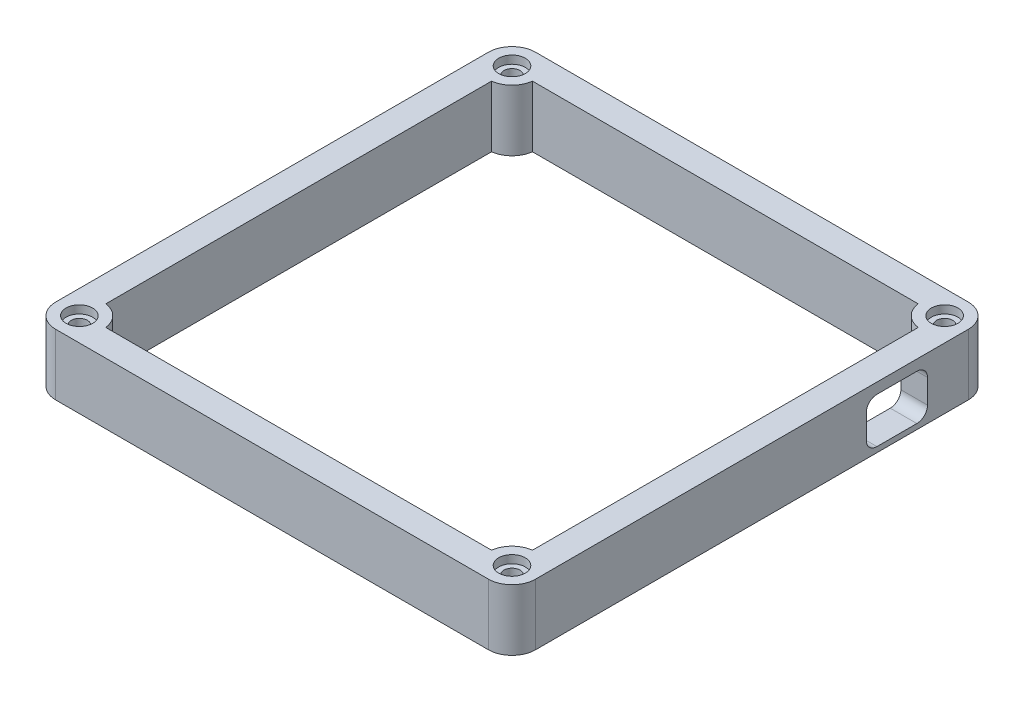
ISO-10303-21;
HEADER;
FILE_DESCRIPTION(('STEP AP214'),'2;1');
FILE_NAME('part.step','',(''),(''),'','','');
FILE_SCHEMA(('AUTOMOTIVE_DESIGN { 1 0 10303 214 1 1 1 1 }'));
ENDSEC;
DATA;
#1=APPLICATION_CONTEXT('core data for automotive mechanical design processes');
#2=APPLICATION_PROTOCOL_DEFINITION('international standard','automotive_design',2000,#1);
#3=PRODUCT_CONTEXT('',#1,'mechanical');
#4=PRODUCT('Part','Part','',(#3));
#5=PRODUCT_RELATED_PRODUCT_CATEGORY('part','',(#4));
#6=PRODUCT_DEFINITION_FORMATION('','',#4);
#7=PRODUCT_DEFINITION_CONTEXT('part definition',#1,'design');
#8=PRODUCT_DEFINITION('design','',#6,#7);
#9=PRODUCT_DEFINITION_SHAPE('','',#8);
#10=(LENGTH_UNIT() NAMED_UNIT(*) SI_UNIT(.MILLI.,.METRE.));
#11=(NAMED_UNIT(*) PLANE_ANGLE_UNIT() SI_UNIT($,.RADIAN.));
#12=(NAMED_UNIT(*) SI_UNIT($,.STERADIAN.) SOLID_ANGLE_UNIT());
#13=UNCERTAINTY_MEASURE_WITH_UNIT(LENGTH_MEASURE(1.E-05),#10,'distance_accuracy_value','');
#14=(GEOMETRIC_REPRESENTATION_CONTEXT(3) GLOBAL_UNCERTAINTY_ASSIGNED_CONTEXT((#13)) GLOBAL_UNIT_ASSIGNED_CONTEXT((#10,
#11,#12)) REPRESENTATION_CONTEXT('',''));
#15=CARTESIAN_POINT('',(0.,0.,0.));
#16=DIRECTION('',(0.,0.,1.));
#17=DIRECTION('',(1.,0.,0.));
#18=AXIS2_PLACEMENT_3D('',#15,#16,#17);
#19=CARTESIAN_POINT('',(45.0808846481362,11.5,0.));
#20=DIRECTION('',(1.,0.,0.));
#21=DIRECTION('',(0.,0.,-1.));
#22=AXIS2_PLACEMENT_3D('',#19,#20,#21);
#23=PLANE('',#22);
#24=DIRECTION('',(0.,0.,1.));
#25=VECTOR('',#24,1.);
#26=CARTESIAN_POINT('',(45.0808846481362,0.,0.));
#27=LINE('',#26,#25);
#28=CARTESIAN_POINT('',(45.0808846481362,0.,-40.64));
#29=VERTEX_POINT('',#28);
#30=CARTESIAN_POINT('',(45.0808846481362,0.,40.64));
#31=VERTEX_POINT('',#30);
#32=EDGE_CURVE('E379',#29,#31,#27,.T.);
#33=ORIENTED_EDGE('',*,*,#32,.F.);
#34=DIRECTION('',(0.,-1.,0.));
#35=VECTOR('',#34,1.);
#36=CARTESIAN_POINT('',(45.0808846481362,11.5,-40.64));
#37=LINE('',#36,#35);
#38=CARTESIAN_POINT('',(45.0808846481362,11.5,-40.64));
#39=VERTEX_POINT('',#38);
#40=EDGE_CURVE('E418',#39,#29,#37,.T.);
#41=ORIENTED_EDGE('',*,*,#40,.F.);
#42=DIRECTION('',(0.,0.,1.));
#43=VECTOR('',#42,1.);
#44=CARTESIAN_POINT('',(45.0808846481362,11.5,0.));
#45=LINE('',#44,#43);
#46=CARTESIAN_POINT('',(45.0808846481362,11.5,40.64));
#47=VERTEX_POINT('',#46);
#48=EDGE_CURVE('E321',#39,#47,#45,.T.);
#49=ORIENTED_EDGE('',*,*,#48,.T.);
#50=DIRECTION('',(0.,-1.,0.));
#51=VECTOR('',#50,1.);
#52=CARTESIAN_POINT('',(45.0808846481362,11.5,40.64));
#53=LINE('',#52,#51);
#54=EDGE_CURVE('E421',#47,#31,#53,.T.);
#55=ORIENTED_EDGE('',*,*,#54,.T.);
#56=EDGE_LOOP('',(#33,#41,#49,#55));
#57=FACE_BOUND('',#56,.T.);
#58=DIRECTION('',(0.,-1.,0.));
#59=VECTOR('',#58,1.);
#60=CARTESIAN_POINT('',(45.0808846481362,0.,-32.979));
#61=LINE('',#60,#59);
#62=CARTESIAN_POINT('',(45.0808846481362,7.5,-32.979));
#63=VERTEX_POINT('',#62);
#64=CARTESIAN_POINT('',(45.0808846481362,3.,-32.979));
#65=VERTEX_POINT('',#64);
#66=EDGE_CURVE('E220',#63,#65,#61,.T.);
#67=ORIENTED_EDGE('',*,*,#66,.T.);
#68=CARTESIAN_POINT('',(45.0808846481362,3.,-30.979));
#69=DIRECTION('',(1.,0.,0.));
#70=DIRECTION('',(0.,0.,-1.));
#71=AXIS2_PLACEMENT_3D('',#68,#69,#70);
#72=CIRCLE('',#71,2.);
#73=CARTESIAN_POINT('',(45.0808846481362,0.999999999999999,-30.979));
#74=VERTEX_POINT('',#73);
#75=EDGE_CURVE('E61',#65,#74,#72,.F.);
#76=ORIENTED_EDGE('',*,*,#75,.T.);
#77=DIRECTION('',(0.,0.,1.));
#78=VECTOR('',#77,1.);
#79=CARTESIAN_POINT('',(45.0808846481362,0.999999999999999,0.));
#80=LINE('',#79,#78);
#81=CARTESIAN_POINT('',(45.0808846481362,0.999999999999999,-23.479));
#82=VERTEX_POINT('',#81);
#83=EDGE_CURVE('E246',#74,#82,#80,.T.);
#84=ORIENTED_EDGE('',*,*,#83,.T.);
#85=CARTESIAN_POINT('',(45.0808846481362,3.,-23.479));
#86=DIRECTION('',(1.,0.,0.));
#87=DIRECTION('',(0.,0.,-1.));
#88=AXIS2_PLACEMENT_3D('',#85,#86,#87);
#89=CIRCLE('',#88,2.);
#90=CARTESIAN_POINT('',(45.0808846481362,3.,-21.479));
#91=VERTEX_POINT('',#90);
#92=EDGE_CURVE('E242',#82,#91,#89,.F.);
#93=ORIENTED_EDGE('',*,*,#92,.T.);
#94=DIRECTION('',(0.,1.,0.));
#95=VECTOR('',#94,1.);
#96=CARTESIAN_POINT('',(45.0808846481362,0.,-21.479));
#97=LINE('',#96,#95);
#98=CARTESIAN_POINT('',(45.0808846481362,7.5,-21.479));
#99=VERTEX_POINT('',#98);
#100=EDGE_CURVE('E238',#91,#99,#97,.T.);
#101=ORIENTED_EDGE('',*,*,#100,.T.);
#102=CARTESIAN_POINT('',(45.0808846481362,7.5,-23.479));
#103=DIRECTION('',(1.,0.,0.));
#104=DIRECTION('',(0.,0.,-1.));
#105=AXIS2_PLACEMENT_3D('',#102,#103,#104);
#106=CIRCLE('',#105,2.);
#107=CARTESIAN_POINT('',(45.0808846481362,9.5,-23.479));
#108=VERTEX_POINT('',#107);
#109=EDGE_CURVE('E231',#108,#99,#106,.T.);
#110=ORIENTED_EDGE('',*,*,#109,.F.);
#111=DIRECTION('',(0.,0.,-1.));
#112=VECTOR('',#111,1.);
#113=CARTESIAN_POINT('',(45.0808846481362,9.5,0.));
#114=LINE('',#113,#112);
#115=CARTESIAN_POINT('',(45.0808846481362,9.5,-30.979));
#116=VERTEX_POINT('',#115);
#117=EDGE_CURVE('E227',#108,#116,#114,.T.);
#118=ORIENTED_EDGE('',*,*,#117,.T.);
#119=CARTESIAN_POINT('',(45.0808846481362,7.5,-30.979));
#120=DIRECTION('',(1.,0.,0.));
#121=DIRECTION('',(0.,0.,-1.));
#122=AXIS2_PLACEMENT_3D('',#119,#120,#121);
#123=CIRCLE('',#122,2.);
#124=EDGE_CURVE('E210',#63,#116,#123,.T.);
#125=ORIENTED_EDGE('',*,*,#124,.F.);
#126=EDGE_LOOP('',(#67,#76,#84,#93,#101,#110,#118,#125));
#127=FACE_BOUND('',#126,.T.);
#128=ADVANCED_FACE('F43',(#57,#127),#23,.T.);
#129=CARTESIAN_POINT('',(40.0808846481362,11.5,0.));
#130=DIRECTION('',(-1.,0.,0.));
#131=DIRECTION('',(0.,0.,1.));
#132=AXIS2_PLACEMENT_3D('',#129,#130,#131);
#133=PLANE('',#132);
#134=DIRECTION('',(0.,0.,-1.));
#135=VECTOR('',#134,1.);
#136=CARTESIAN_POINT('',(40.0808846481362,0.,0.));
#137=LINE('',#136,#135);
#138=CARTESIAN_POINT('',(40.0808846481362,0.,36.2344527602848));
#139=VERTEX_POINT('',#138);
#140=CARTESIAN_POINT('',(40.0808846481362,0.,-36.2344527602848));
#141=VERTEX_POINT('',#140);
#142=EDGE_CURVE('E367',#139,#141,#137,.T.);
#143=ORIENTED_EDGE('',*,*,#142,.F.);
#144=DIRECTION('',(0.,-1.,0.));
#145=VECTOR('',#144,1.);
#146=CARTESIAN_POINT('',(40.0808846481362,11.5,36.2344527602848));
#147=LINE('',#146,#145);
#148=CARTESIAN_POINT('',(40.0808846481362,11.5,36.2344527602848));
#149=VERTEX_POINT('',#148);
#150=EDGE_CURVE('E342',#149,#139,#147,.T.);
#151=ORIENTED_EDGE('',*,*,#150,.F.);
#152=DIRECTION('',(0.,0.,-1.));
#153=VECTOR('',#152,1.);
#154=CARTESIAN_POINT('',(40.0808846481362,11.5,0.));
#155=LINE('',#154,#153);
#156=CARTESIAN_POINT('',(40.0808846481362,11.5,-36.2344527602848));
#157=VERTEX_POINT('',#156);
#158=EDGE_CURVE('E310',#149,#157,#155,.T.);
#159=ORIENTED_EDGE('',*,*,#158,.T.);
#160=DIRECTION('',(0.,-1.,0.));
#161=VECTOR('',#160,1.);
#162=CARTESIAN_POINT('',(40.0808846481362,11.5,-36.2344527602848));
#163=LINE('',#162,#161);
#164=EDGE_CURVE('E430',#157,#141,#163,.T.);
#165=ORIENTED_EDGE('',*,*,#164,.T.);
#166=EDGE_LOOP('',(#143,#151,#159,#165));
#167=FACE_BOUND('',#166,.T.);
#168=DIRECTION('',(0.,0.,-1.));
#169=VECTOR('',#168,1.);
#170=CARTESIAN_POINT('',(40.0808846481362,0.999999999999999,0.));
#171=LINE('',#170,#169);
#172=CARTESIAN_POINT('',(40.0808846481362,0.999999999999999,-23.479));
#173=VERTEX_POINT('',#172);
#174=CARTESIAN_POINT('',(40.0808846481362,0.999999999999999,-30.979));
#175=VERTEX_POINT('',#174);
#176=EDGE_CURVE('E53',#173,#175,#171,.T.);
#177=ORIENTED_EDGE('',*,*,#176,.T.);
#178=CARTESIAN_POINT('',(40.0808846481362,3.,-30.979));
#179=DIRECTION('',(-1.,0.,0.));
#180=DIRECTION('',(0.,0.,1.));
#181=AXIS2_PLACEMENT_3D('',#178,#179,#180);
#182=CIRCLE('',#181,2.);
#183=CARTESIAN_POINT('',(40.0808846481362,3.,-32.979));
#184=VERTEX_POINT('',#183);
#185=EDGE_CURVE('E11',#175,#184,#182,.F.);
#186=ORIENTED_EDGE('',*,*,#185,.T.);
#187=DIRECTION('',(0.,1.,0.));
#188=VECTOR('',#187,1.);
#189=CARTESIAN_POINT('',(40.0808846481362,11.5,-32.979));
#190=LINE('',#189,#188);
#191=CARTESIAN_POINT('',(40.0808846481362,7.5,-32.979));
#192=VERTEX_POINT('',#191);
#193=EDGE_CURVE('E427',#184,#192,#190,.T.);
#194=ORIENTED_EDGE('',*,*,#193,.T.);
#195=CARTESIAN_POINT('',(40.0808846481362,7.5,-30.979));
#196=DIRECTION('',(-1.,0.,0.));
#197=DIRECTION('',(0.,0.,1.));
#198=AXIS2_PLACEMENT_3D('',#195,#196,#197);
#199=CIRCLE('',#198,2.);
#200=CARTESIAN_POINT('',(40.0808846481362,9.5,-30.979));
#201=VERTEX_POINT('',#200);
#202=EDGE_CURVE('E213',#201,#192,#199,.T.);
#203=ORIENTED_EDGE('',*,*,#202,.F.);
#204=DIRECTION('',(0.,0.,1.));
#205=VECTOR('',#204,1.);
#206=CARTESIAN_POINT('',(40.0808846481362,9.5,0.));
#207=LINE('',#206,#205);
#208=CARTESIAN_POINT('',(40.0808846481362,9.5,-23.479));
#209=VERTEX_POINT('',#208);
#210=EDGE_CURVE('E458',#201,#209,#207,.T.);
#211=ORIENTED_EDGE('',*,*,#210,.T.);
#212=CARTESIAN_POINT('',(40.0808846481362,7.5,-23.479));
#213=DIRECTION('',(-1.,0.,0.));
#214=DIRECTION('',(0.,0.,1.));
#215=AXIS2_PLACEMENT_3D('',#212,#213,#214);
#216=CIRCLE('',#215,2.);
#217=CARTESIAN_POINT('',(40.0808846481362,7.5,-21.479));
#218=VERTEX_POINT('',#217);
#219=EDGE_CURVE('E462',#218,#209,#216,.T.);
#220=ORIENTED_EDGE('',*,*,#219,.F.);
#221=DIRECTION('',(0.,-1.,0.));
#222=VECTOR('',#221,1.);
#223=CARTESIAN_POINT('',(40.0808846481362,11.5,-21.479));
#224=LINE('',#223,#222);
#225=CARTESIAN_POINT('',(40.0808846481362,3.,-21.479));
#226=VERTEX_POINT('',#225);
#227=EDGE_CURVE('E465',#218,#226,#224,.T.);
#228=ORIENTED_EDGE('',*,*,#227,.T.);
#229=CARTESIAN_POINT('',(40.0808846481362,3.,-23.479));
#230=DIRECTION('',(-1.,0.,0.));
#231=DIRECTION('',(0.,0.,1.));
#232=AXIS2_PLACEMENT_3D('',#229,#230,#231);
#233=CIRCLE('',#232,2.);
#234=EDGE_CURVE('E469',#226,#173,#233,.F.);
#235=ORIENTED_EDGE('',*,*,#234,.T.);
#236=EDGE_LOOP('',(#177,#186,#194,#203,#211,#220,#228,#235));
#237=FACE_BOUND('',#236,.T.);
#238=ADVANCED_FACE('F596',(#167,#237),#133,.T.);
#239=CARTESIAN_POINT('',(0.,11.5,45.0808846481362));
#240=DIRECTION('',(0.,0.,-1.));
#241=DIRECTION('',(-1.,0.,0.));
#242=AXIS2_PLACEMENT_3D('',#239,#240,#241);
#243=PLANE('',#242);
#244=DIRECTION('',(1.,0.,0.));
#245=VECTOR('',#244,1.);
#246=CARTESIAN_POINT('',(0.,0.,45.0808846481362));
#247=LINE('',#246,#245);
#248=CARTESIAN_POINT('',(-40.64,0.,45.0808846481362));
#249=VERTEX_POINT('',#248);
#250=CARTESIAN_POINT('',(40.64,0.,45.0808846481362));
#251=VERTEX_POINT('',#250);
#252=EDGE_CURVE('E371',#249,#251,#247,.T.);
#253=ORIENTED_EDGE('',*,*,#252,.T.);
#254=DIRECTION('',(0.,-1.,0.));
#255=VECTOR('',#254,1.);
#256=CARTESIAN_POINT('',(40.64,11.5,45.0808846481362));
#257=LINE('',#256,#255);
#258=CARTESIAN_POINT('',(40.64,11.5,45.0808846481362));
#259=VERTEX_POINT('',#258);
#260=EDGE_CURVE('E424',#259,#251,#257,.T.);
#261=ORIENTED_EDGE('',*,*,#260,.F.);
#262=DIRECTION('',(1.,0.,0.));
#263=VECTOR('',#262,1.);
#264=CARTESIAN_POINT('',(0.,11.5,45.0808846481362));
#265=LINE('',#264,#263);
#266=CARTESIAN_POINT('',(-40.64,11.5,45.0808846481362));
#267=VERTEX_POINT('',#266);
#268=EDGE_CURVE('E314',#267,#259,#265,.T.);
#269=ORIENTED_EDGE('',*,*,#268,.F.);
#270=DIRECTION('',(0.,-1.,0.));
#271=VECTOR('',#270,1.);
#272=CARTESIAN_POINT('',(-40.64,11.5,45.0808846481362));
#273=LINE('',#272,#271);
#274=EDGE_CURVE('E401',#267,#249,#273,.T.);
#275=ORIENTED_EDGE('',*,*,#274,.T.);
#276=EDGE_LOOP('',(#253,#261,#269,#275));
#277=FACE_BOUND('',#276,.T.);
#278=ADVANCED_FACE('F557',(#277),#243,.F.);
#279=CARTESIAN_POINT('',(40.64,11.5,40.64));
#280=DIRECTION('',(0.,-1.,0.));
#281=DIRECTION('',(0.,0.,-1.));
#282=AXIS2_PLACEMENT_3D('',#279,#280,#281);
#283=CYLINDRICAL_SURFACE('',#282,4.44088464813619);
#284=CARTESIAN_POINT('',(40.64,0.,40.64));
#285=DIRECTION('',(0.,1.,0.));
#286=DIRECTION('',(0.,0.,1.));
#287=AXIS2_PLACEMENT_3D('',#284,#285,#286);
#288=CIRCLE('',#287,4.44088464813619);
#289=EDGE_CURVE('E375',#31,#251,#288,.F.);
#290=ORIENTED_EDGE('',*,*,#289,.F.);
#291=ORIENTED_EDGE('',*,*,#54,.F.);
#292=CARTESIAN_POINT('',(40.64,11.5,40.64));
#293=DIRECTION('',(0.,1.,0.));
#294=DIRECTION('',(0.,0.,1.));
#295=AXIS2_PLACEMENT_3D('',#292,#293,#294);
#296=CIRCLE('',#295,4.44088464813619);
#297=EDGE_CURVE('E317',#47,#259,#296,.F.);
#298=ORIENTED_EDGE('',*,*,#297,.T.);
#299=ORIENTED_EDGE('',*,*,#260,.T.);
#300=EDGE_LOOP('',(#290,#291,#298,#299));
#301=FACE_BOUND('',#300,.T.);
#302=ADVANCED_FACE('F561',(#301),#283,.T.);
#303=CARTESIAN_POINT('',(40.64,11.5,-40.64));
#304=DIRECTION('',(0.,-1.,0.));
#305=DIRECTION('',(0.,0.,-1.));
#306=AXIS2_PLACEMENT_3D('',#303,#304,#305);
#307=CYLINDRICAL_SURFACE('',#306,4.44088464813619);
#308=CARTESIAN_POINT('',(40.64,0.,-40.64));
#309=DIRECTION('',(0.,1.,0.));
#310=DIRECTION('',(0.,0.,1.));
#311=AXIS2_PLACEMENT_3D('',#308,#309,#310);
#312=CIRCLE('',#311,4.44088464813619);
#313=CARTESIAN_POINT('',(40.64,0.,-45.0808846481362));
#314=VERTEX_POINT('',#313);
#315=EDGE_CURVE('E383',#29,#314,#312,.T.);
#316=ORIENTED_EDGE('',*,*,#315,.T.);
#317=DIRECTION('',(0.,-1.,0.));
#318=VECTOR('',#317,1.);
#319=CARTESIAN_POINT('',(40.64,11.5,-45.0808846481362));
#320=LINE('',#319,#318);
#321=CARTESIAN_POINT('',(40.64,11.5,-45.0808846481362));
#322=VERTEX_POINT('',#321);
#323=EDGE_CURVE('E415',#322,#314,#320,.T.);
#324=ORIENTED_EDGE('',*,*,#323,.F.);
#325=CARTESIAN_POINT('',(40.64,11.5,-40.64));
#326=DIRECTION('',(0.,1.,0.));
#327=DIRECTION('',(0.,0.,1.));
#328=AXIS2_PLACEMENT_3D('',#325,#326,#327);
#329=CIRCLE('',#328,4.44088464813619);
#330=EDGE_CURVE('E325',#39,#322,#329,.T.);
#331=ORIENTED_EDGE('',*,*,#330,.F.);
#332=ORIENTED_EDGE('',*,*,#40,.T.);
#333=EDGE_LOOP('',(#316,#324,#331,#332));
#334=FACE_BOUND('',#333,.T.);
#335=ADVANCED_FACE('F568',(#334),#307,.T.);
#336=CARTESIAN_POINT('',(0.,11.5,-45.0808846481362));
#337=DIRECTION('',(0.,0.,-1.));
#338=DIRECTION('',(-1.,0.,0.));
#339=AXIS2_PLACEMENT_3D('',#336,#337,#338);
#340=PLANE('',#339);
#341=DIRECTION('',(1.,0.,0.));
#342=VECTOR('',#341,1.);
#343=CARTESIAN_POINT('',(0.,0.,-45.0808846481362));
#344=LINE('',#343,#342);
#345=CARTESIAN_POINT('',(-40.64,0.,-45.0808846481362));
#346=VERTEX_POINT('',#345);
#347=EDGE_CURVE('E387',#346,#314,#344,.T.);
#348=ORIENTED_EDGE('',*,*,#347,.F.);
#349=DIRECTION('',(0.,-1.,0.));
#350=VECTOR('',#349,1.);
#351=CARTESIAN_POINT('',(-40.64,11.5,-45.0808846481362));
#352=LINE('',#351,#350);
#353=CARTESIAN_POINT('',(-40.64,11.5,-45.0808846481362));
#354=VERTEX_POINT('',#353);
#355=EDGE_CURVE('E412',#354,#346,#352,.T.);
#356=ORIENTED_EDGE('',*,*,#355,.F.);
#357=DIRECTION('',(1.,0.,0.));
#358=VECTOR('',#357,1.);
#359=CARTESIAN_POINT('',(0.,11.5,-45.0808846481362));
#360=LINE('',#359,#358);
#361=EDGE_CURVE('E328',#354,#322,#360,.T.);
#362=ORIENTED_EDGE('',*,*,#361,.T.);
#363=ORIENTED_EDGE('',*,*,#323,.T.);
#364=EDGE_LOOP('',(#348,#356,#362,#363));
#365=FACE_BOUND('',#364,.T.);
#366=ADVANCED_FACE('F572',(#365),#340,.T.);
#367=CARTESIAN_POINT('',(-40.64,11.5,-40.64));
#368=DIRECTION('',(0.,-1.,0.));
#369=DIRECTION('',(0.,0.,-1.));
#370=AXIS2_PLACEMENT_3D('',#367,#368,#369);
#371=CYLINDRICAL_SURFACE('',#370,4.44088464813619);
#372=CARTESIAN_POINT('',(-40.64,0.,-40.64));
#373=DIRECTION('',(0.,1.,0.));
#374=DIRECTION('',(0.,0.,1.));
#375=AXIS2_PLACEMENT_3D('',#372,#373,#374);
#376=CIRCLE('',#375,4.44088464813619);
#377=CARTESIAN_POINT('',(-45.0808846481362,0.,-40.64));
#378=VERTEX_POINT('',#377);
#379=EDGE_CURVE('E391',#346,#378,#376,.T.);
#380=ORIENTED_EDGE('',*,*,#379,.T.);
#381=DIRECTION('',(0.,-1.,0.));
#382=VECTOR('',#381,1.);
#383=CARTESIAN_POINT('',(-45.0808846481362,11.5,-40.64));
#384=LINE('',#383,#382);
#385=CARTESIAN_POINT('',(-45.0808846481362,11.5,-40.64));
#386=VERTEX_POINT('',#385);
#387=EDGE_CURVE('E409',#386,#378,#384,.T.);
#388=ORIENTED_EDGE('',*,*,#387,.F.);
#389=CARTESIAN_POINT('',(-40.64,11.5,-40.64));
#390=DIRECTION('',(0.,1.,0.));
#391=DIRECTION('',(0.,0.,1.));
#392=AXIS2_PLACEMENT_3D('',#389,#390,#391);
#393=CIRCLE('',#392,4.44088464813619);
#394=EDGE_CURVE('E332',#354,#386,#393,.T.);
#395=ORIENTED_EDGE('',*,*,#394,.F.);
#396=ORIENTED_EDGE('',*,*,#355,.T.);
#397=EDGE_LOOP('',(#380,#388,#395,#396));
#398=FACE_BOUND('',#397,.T.);
#399=ADVANCED_FACE('F577',(#398),#371,.T.);
#400=CARTESIAN_POINT('',(-45.0808846481362,11.5,0.));
#401=DIRECTION('',(-1.,0.,0.));
#402=DIRECTION('',(0.,0.,1.));
#403=AXIS2_PLACEMENT_3D('',#400,#401,#402);
#404=PLANE('',#403);
#405=DIRECTION('',(0.,0.,-1.));
#406=VECTOR('',#405,1.);
#407=CARTESIAN_POINT('',(-45.0808846481362,0.,0.));
#408=LINE('',#407,#406);
#409=CARTESIAN_POINT('',(-45.0808846481362,0.,40.64));
#410=VERTEX_POINT('',#409);
#411=EDGE_CURVE('E395',#410,#378,#408,.T.);
#412=ORIENTED_EDGE('',*,*,#411,.F.);
#413=DIRECTION('',(0.,-1.,0.));
#414=VECTOR('',#413,1.);
#415=CARTESIAN_POINT('',(-45.0808846481362,11.5,40.64));
#416=LINE('',#415,#414);
#417=CARTESIAN_POINT('',(-45.0808846481362,11.5,40.64));
#418=VERTEX_POINT('',#417);
#419=EDGE_CURVE('E405',#418,#410,#416,.T.);
#420=ORIENTED_EDGE('',*,*,#419,.F.);
#421=DIRECTION('',(0.,0.,-1.));
#422=VECTOR('',#421,1.);
#423=CARTESIAN_POINT('',(-45.0808846481362,11.5,0.));
#424=LINE('',#423,#422);
#425=EDGE_CURVE('E335',#418,#386,#424,.T.);
#426=ORIENTED_EDGE('',*,*,#425,.T.);
#427=ORIENTED_EDGE('',*,*,#387,.T.);
#428=EDGE_LOOP('',(#412,#420,#426,#427));
#429=FACE_BOUND('',#428,.T.);
#430=ADVANCED_FACE('F580',(#429),#404,.T.);
#431=CARTESIAN_POINT('',(40.64,11.5,40.64));
#432=DIRECTION('',(0.,-1.,0.));
#433=DIRECTION('',(0.,0.,-1.));
#434=AXIS2_PLACEMENT_3D('',#431,#432,#433);
#435=CYLINDRICAL_SURFACE('',#434,4.44088464813619);
#436=CARTESIAN_POINT('',(40.64,0.,40.64));
#437=DIRECTION('',(0.,1.,0.));
#438=DIRECTION('',(0.,0.,1.));
#439=AXIS2_PLACEMENT_3D('',#436,#437,#438);
#440=CIRCLE('',#439,4.44088464813619);
#441=CARTESIAN_POINT('',(36.2344527602848,0.,40.0808846481362));
#442=VERTEX_POINT('',#441);
#443=EDGE_CURVE('E285',#139,#442,#440,.T.);
#444=ORIENTED_EDGE('',*,*,#443,.T.);
#445=DIRECTION('',(0.,-1.,0.));
#446=VECTOR('',#445,1.);
#447=CARTESIAN_POINT('',(36.2344527602848,11.5,40.0808846481362));
#448=LINE('',#447,#446);
#449=CARTESIAN_POINT('',(36.2344527602848,11.5,40.0808846481362));
#450=VERTEX_POINT('',#449);
#451=EDGE_CURVE('E406',#450,#442,#448,.T.);
#452=ORIENTED_EDGE('',*,*,#451,.F.);
#453=CARTESIAN_POINT('',(40.64,11.5,40.64));
#454=DIRECTION('',(0.,1.,0.));
#455=DIRECTION('',(0.,0.,1.));
#456=AXIS2_PLACEMENT_3D('',#453,#454,#455);
#457=CIRCLE('',#456,4.44088464813619);
#458=EDGE_CURVE('E286',#149,#450,#457,.T.);
#459=ORIENTED_EDGE('',*,*,#458,.F.);
#460=ORIENTED_EDGE('',*,*,#150,.T.);
#461=EDGE_LOOP('',(#444,#452,#459,#460));
#462=FACE_BOUND('',#461,.T.);
#463=ADVANCED_FACE('F45',(#462),#435,.T.);
#464=CARTESIAN_POINT('',(0.,11.5,40.0808846481362));
#465=DIRECTION('',(0.,0.,1.));
#466=DIRECTION('',(1.,0.,0.));
#467=AXIS2_PLACEMENT_3D('',#464,#465,#466);
#468=PLANE('',#467);
#469=DIRECTION('',(-1.,0.,0.));
#470=VECTOR('',#469,1.);
#471=CARTESIAN_POINT('',(0.,0.,40.0808846481362));
#472=LINE('',#471,#470);
#473=CARTESIAN_POINT('',(-36.2344527602848,0.,40.0808846481362));
#474=VERTEX_POINT('',#473);
#475=EDGE_CURVE('E346',#442,#474,#472,.T.);
#476=ORIENTED_EDGE('',*,*,#475,.T.);
#477=DIRECTION('',(0.,-1.,0.));
#478=VECTOR('',#477,1.);
#479=CARTESIAN_POINT('',(-36.2344527602848,11.5,40.0808846481362));
#480=LINE('',#479,#478);
#481=CARTESIAN_POINT('',(-36.2344527602848,11.5,40.0808846481362));
#482=VERTEX_POINT('',#481);
#483=EDGE_CURVE('E447',#482,#474,#480,.T.);
#484=ORIENTED_EDGE('',*,*,#483,.F.);
#485=DIRECTION('',(-1.,0.,0.));
#486=VECTOR('',#485,1.);
#487=CARTESIAN_POINT('',(0.,11.5,40.0808846481362));
#488=LINE('',#487,#486);
#489=EDGE_CURVE('E290',#450,#482,#488,.T.);
#490=ORIENTED_EDGE('',*,*,#489,.F.);
#491=ORIENTED_EDGE('',*,*,#451,.T.);
#492=EDGE_LOOP('',(#476,#484,#490,#491));
#493=FACE_BOUND('',#492,.T.);
#494=ADVANCED_FACE('F628',(#493),#468,.F.);
#495=CARTESIAN_POINT('',(-40.64,11.5,40.64));
#496=DIRECTION('',(0.,-1.,0.));
#497=DIRECTION('',(0.,0.,-1.));
#498=AXIS2_PLACEMENT_3D('',#495,#496,#497);
#499=CYLINDRICAL_SURFACE('',#498,4.44088464813619);
#500=CARTESIAN_POINT('',(-40.64,0.,40.64));
#501=DIRECTION('',(0.,1.,0.));
#502=DIRECTION('',(0.,0.,1.));
#503=AXIS2_PLACEMENT_3D('',#500,#501,#502);
#504=CIRCLE('',#503,4.44088464813619);
#505=CARTESIAN_POINT('',(-40.0808846481362,0.,36.2344527602848));
#506=VERTEX_POINT('',#505);
#507=EDGE_CURVE('E349',#474,#506,#504,.T.);
#508=ORIENTED_EDGE('',*,*,#507,.T.);
#509=DIRECTION('',(0.,-1.,0.));
#510=VECTOR('',#509,1.);
#511=CARTESIAN_POINT('',(-40.0808846481362,11.5,36.2344527602848));
#512=LINE('',#511,#510);
#513=CARTESIAN_POINT('',(-40.0808846481362,11.5,36.2344527602848));
#514=VERTEX_POINT('',#513);
#515=EDGE_CURVE('E443',#514,#506,#512,.T.);
#516=ORIENTED_EDGE('',*,*,#515,.F.);
#517=CARTESIAN_POINT('',(-40.64,11.5,40.64));
#518=DIRECTION('',(0.,1.,0.));
#519=DIRECTION('',(0.,0.,1.));
#520=AXIS2_PLACEMENT_3D('',#517,#518,#519);
#521=CIRCLE('',#520,4.44088464813619);
#522=EDGE_CURVE('E294',#482,#514,#521,.T.);
#523=ORIENTED_EDGE('',*,*,#522,.F.);
#524=ORIENTED_EDGE('',*,*,#483,.T.);
#525=EDGE_LOOP('',(#508,#516,#523,#524));
#526=FACE_BOUND('',#525,.T.);
#527=ADVANCED_FACE('F625',(#526),#499,.T.);
#528=CARTESIAN_POINT('',(-40.0808846481362,11.5,0.));
#529=DIRECTION('',(-1.,0.,0.));
#530=DIRECTION('',(0.,0.,1.));
#531=AXIS2_PLACEMENT_3D('',#528,#529,#530);
#532=PLANE('',#531);
#533=DIRECTION('',(0.,0.,-1.));
#534=VECTOR('',#533,1.);
#535=CARTESIAN_POINT('',(-40.0808846481362,0.,0.));
#536=LINE('',#535,#534);
#537=CARTESIAN_POINT('',(-40.0808846481362,0.,-36.2344527602848));
#538=VERTEX_POINT('',#537);
#539=EDGE_CURVE('E352',#506,#538,#536,.T.);
#540=ORIENTED_EDGE('',*,*,#539,.T.);
#541=DIRECTION('',(0.,-1.,0.));
#542=VECTOR('',#541,1.);
#543=CARTESIAN_POINT('',(-40.0808846481362,11.5,-36.2344527602848));
#544=LINE('',#543,#542);
#545=CARTESIAN_POINT('',(-40.0808846481362,11.5,-36.2344527602848));
#546=VERTEX_POINT('',#545);
#547=EDGE_CURVE('E439',#546,#538,#544,.T.);
#548=ORIENTED_EDGE('',*,*,#547,.F.);
#549=DIRECTION('',(0.,0.,-1.));
#550=VECTOR('',#549,1.);
#551=CARTESIAN_POINT('',(-40.0808846481362,11.5,0.));
#552=LINE('',#551,#550);
#553=EDGE_CURVE('E297',#514,#546,#552,.T.);
#554=ORIENTED_EDGE('',*,*,#553,.F.);
#555=ORIENTED_EDGE('',*,*,#515,.T.);
#556=EDGE_LOOP('',(#540,#548,#554,#555));
#557=FACE_BOUND('',#556,.T.);
#558=ADVANCED_FACE('F621',(#557),#532,.F.);
#559=CARTESIAN_POINT('',(-40.64,11.5,-40.64));
#560=DIRECTION('',(0.,-1.,0.));
#561=DIRECTION('',(0.,0.,-1.));
#562=AXIS2_PLACEMENT_3D('',#559,#560,#561);
#563=CYLINDRICAL_SURFACE('',#562,4.44088464813619);
#564=CARTESIAN_POINT('',(-40.64,0.,-40.64));
#565=DIRECTION('',(0.,1.,0.));
#566=DIRECTION('',(0.,0.,1.));
#567=AXIS2_PLACEMENT_3D('',#564,#565,#566);
#568=CIRCLE('',#567,4.44088464813619);
#569=CARTESIAN_POINT('',(-36.2344527602848,0.,-40.0808846481362));
#570=VERTEX_POINT('',#569);
#571=EDGE_CURVE('E355',#538,#570,#568,.T.);
#572=ORIENTED_EDGE('',*,*,#571,.T.);
#573=DIRECTION('',(0.,-1.,0.));
#574=VECTOR('',#573,1.);
#575=CARTESIAN_POINT('',(-36.2344527602848,11.5,-40.0808846481362));
#576=LINE('',#575,#574);
#577=CARTESIAN_POINT('',(-36.2344527602848,11.5,-40.0808846481362));
#578=VERTEX_POINT('',#577);
#579=EDGE_CURVE('E436',#578,#570,#576,.T.);
#580=ORIENTED_EDGE('',*,*,#579,.F.);
#581=CARTESIAN_POINT('',(-40.64,11.5,-40.64));
#582=DIRECTION('',(0.,1.,0.));
#583=DIRECTION('',(0.,0.,1.));
#584=AXIS2_PLACEMENT_3D('',#581,#582,#583);
#585=CIRCLE('',#584,4.44088464813619);
#586=EDGE_CURVE('E300',#546,#578,#585,.T.);
#587=ORIENTED_EDGE('',*,*,#586,.F.);
#588=ORIENTED_EDGE('',*,*,#547,.T.);
#589=EDGE_LOOP('',(#572,#580,#587,#588));
#590=FACE_BOUND('',#589,.T.);
#591=ADVANCED_FACE('F617',(#590),#563,.T.);
#592=CARTESIAN_POINT('',(0.,11.5,-40.0808846481362));
#593=DIRECTION('',(0.,0.,1.));
#594=DIRECTION('',(1.,0.,0.));
#595=AXIS2_PLACEMENT_3D('',#592,#593,#594);
#596=PLANE('',#595);
#597=DIRECTION('',(-1.,0.,0.));
#598=VECTOR('',#597,1.);
#599=CARTESIAN_POINT('',(0.,0.,-40.0808846481362));
#600=LINE('',#599,#598);
#601=CARTESIAN_POINT('',(36.2344527602848,0.,-40.0808846481362));
#602=VERTEX_POINT('',#601);
#603=EDGE_CURVE('E359',#602,#570,#600,.T.);
#604=ORIENTED_EDGE('',*,*,#603,.F.);
#605=DIRECTION('',(0.,-1.,0.));
#606=VECTOR('',#605,1.);
#607=CARTESIAN_POINT('',(36.2344527602848,11.5,-40.0808846481362));
#608=LINE('',#607,#606);
#609=CARTESIAN_POINT('',(36.2344527602848,11.5,-40.0808846481362));
#610=VERTEX_POINT('',#609);
#611=EDGE_CURVE('E433',#610,#602,#608,.T.);
#612=ORIENTED_EDGE('',*,*,#611,.F.);
#613=DIRECTION('',(-1.,0.,0.));
#614=VECTOR('',#613,1.);
#615=CARTESIAN_POINT('',(0.,11.5,-40.0808846481362));
#616=LINE('',#615,#614);
#617=EDGE_CURVE('E303',#610,#578,#616,.T.);
#618=ORIENTED_EDGE('',*,*,#617,.T.);
#619=ORIENTED_EDGE('',*,*,#579,.T.);
#620=EDGE_LOOP('',(#604,#612,#618,#619));
#621=FACE_BOUND('',#620,.T.);
#622=ADVANCED_FACE('F613',(#621),#596,.T.);
#623=CARTESIAN_POINT('',(40.64,11.5,-40.64));
#624=DIRECTION('',(0.,-1.,0.));
#625=DIRECTION('',(0.,0.,-1.));
#626=AXIS2_PLACEMENT_3D('',#623,#624,#625);
#627=CYLINDRICAL_SURFACE('',#626,4.44088464813619);
#628=CARTESIAN_POINT('',(40.64,0.,-40.64));
#629=DIRECTION('',(0.,1.,0.));
#630=DIRECTION('',(0.,0.,1.));
#631=AXIS2_PLACEMENT_3D('',#628,#629,#630);
#632=CIRCLE('',#631,4.44088464813619);
#633=EDGE_CURVE('E363',#602,#141,#632,.T.);
#634=ORIENTED_EDGE('',*,*,#633,.T.);
#635=ORIENTED_EDGE('',*,*,#164,.F.);
#636=CARTESIAN_POINT('',(40.64,11.5,-40.64));
#637=DIRECTION('',(0.,1.,0.));
#638=DIRECTION('',(0.,0.,1.));
#639=AXIS2_PLACEMENT_3D('',#636,#637,#638);
#640=CIRCLE('',#639,4.44088464813619);
#641=EDGE_CURVE('E307',#610,#157,#640,.T.);
#642=ORIENTED_EDGE('',*,*,#641,.F.);
#643=ORIENTED_EDGE('',*,*,#611,.T.);
#644=EDGE_LOOP('',(#634,#635,#642,#643));
#645=FACE_BOUND('',#644,.T.);
#646=ADVANCED_FACE('F610',(#645),#627,.T.);
#647=CARTESIAN_POINT('',(-40.64,11.5,40.64));
#648=DIRECTION('',(0.,-1.,0.));
#649=DIRECTION('',(0.,0.,-1.));
#650=AXIS2_PLACEMENT_3D('',#647,#648,#649);
#651=CYLINDRICAL_SURFACE('',#650,4.44088464813619);
#652=CARTESIAN_POINT('',(-40.64,0.,40.64));
#653=DIRECTION('',(0.,1.,0.));
#654=DIRECTION('',(0.,0.,1.));
#655=AXIS2_PLACEMENT_3D('',#652,#653,#654);
#656=CIRCLE('',#655,4.44088464813619);
#657=EDGE_CURVE('E291',#410,#249,#656,.T.);
#658=ORIENTED_EDGE('',*,*,#657,.T.);
#659=ORIENTED_EDGE('',*,*,#274,.F.);
#660=CARTESIAN_POINT('',(-40.64,11.5,40.64));
#661=DIRECTION('',(0.,1.,0.));
#662=DIRECTION('',(0.,0.,1.));
#663=AXIS2_PLACEMENT_3D('',#660,#661,#662);
#664=CIRCLE('',#663,4.44088464813619);
#665=EDGE_CURVE('E339',#418,#267,#664,.T.);
#666=ORIENTED_EDGE('',*,*,#665,.F.);
#667=ORIENTED_EDGE('',*,*,#419,.T.);
#668=EDGE_LOOP('',(#658,#659,#666,#667));
#669=FACE_BOUND('',#668,.T.);
#670=ADVANCED_FACE('F540',(#669),#651,.T.);
#671=CARTESIAN_POINT('',(0.,11.5,0.));
#672=DIRECTION('',(0.,1.,0.));
#673=DIRECTION('',(0.,0.,1.));
#674=AXIS2_PLACEMENT_3D('',#671,#672,#673);
#675=PLANE('',#674);
#676=CARTESIAN_POINT('',(-40.64,11.5,40.64));
#677=DIRECTION('',(0.,1.,0.));
#678=DIRECTION('',(0.,0.,1.));
#679=AXIS2_PLACEMENT_3D('',#676,#677,#678);
#680=CIRCLE('',#679,2.5);
#681=CARTESIAN_POINT('',(-40.64,11.5,43.14));
#682=VERTEX_POINT('',#681);
#683=EDGE_CURVE('E503',#682,#682,#680,.T.);
#684=ORIENTED_EDGE('',*,*,#683,.F.);
#685=EDGE_LOOP('',(#684));
#686=FACE_BOUND('',#685,.T.);
#687=CARTESIAN_POINT('',(40.64,11.5,40.64));
#688=DIRECTION('',(0.,1.,0.));
#689=DIRECTION('',(0.,0.,1.));
#690=AXIS2_PLACEMENT_3D('',#687,#688,#689);
#691=CIRCLE('',#690,2.5);
#692=CARTESIAN_POINT('',(40.64,11.5,43.14));
#693=VERTEX_POINT('',#692);
#694=EDGE_CURVE('E511',#693,#693,#691,.T.);
#695=ORIENTED_EDGE('',*,*,#694,.F.);
#696=EDGE_LOOP('',(#695));
#697=FACE_BOUND('',#696,.T.);
#698=CARTESIAN_POINT('',(40.64,11.5,-40.64));
#699=DIRECTION('',(0.,1.,0.));
#700=DIRECTION('',(0.,0.,1.));
#701=AXIS2_PLACEMENT_3D('',#698,#699,#700);
#702=CIRCLE('',#701,2.5);
#703=CARTESIAN_POINT('',(40.64,11.5,-38.14));
#704=VERTEX_POINT('',#703);
#705=EDGE_CURVE('E519',#704,#704,#702,.T.);
#706=ORIENTED_EDGE('',*,*,#705,.F.);
#707=EDGE_LOOP('',(#706));
#708=FACE_BOUND('',#707,.T.);
#709=CARTESIAN_POINT('',(-40.64,11.5,-40.64));
#710=DIRECTION('',(0.,1.,0.));
#711=DIRECTION('',(0.,0.,1.));
#712=AXIS2_PLACEMENT_3D('',#709,#710,#711);
#713=CIRCLE('',#712,2.5);
#714=CARTESIAN_POINT('',(-40.64,11.5,-38.14));
#715=VERTEX_POINT('',#714);
#716=EDGE_CURVE('E495',#715,#715,#713,.T.);
#717=ORIENTED_EDGE('',*,*,#716,.F.);
#718=EDGE_LOOP('',(#717));
#719=FACE_BOUND('',#718,.T.);
#720=ORIENTED_EDGE('',*,*,#458,.T.);
#721=ORIENTED_EDGE('',*,*,#489,.T.);
#722=ORIENTED_EDGE('',*,*,#522,.T.);
#723=ORIENTED_EDGE('',*,*,#553,.T.);
#724=ORIENTED_EDGE('',*,*,#586,.T.);
#725=ORIENTED_EDGE('',*,*,#617,.F.);
#726=ORIENTED_EDGE('',*,*,#641,.T.);
#727=ORIENTED_EDGE('',*,*,#158,.F.);
#728=EDGE_LOOP('',(#720,#721,#722,#723,#724,#725,#726,#727));
#729=FACE_BOUND('',#728,.T.);
#730=ORIENTED_EDGE('',*,*,#268,.T.);
#731=ORIENTED_EDGE('',*,*,#297,.F.);
#732=ORIENTED_EDGE('',*,*,#48,.F.);
#733=ORIENTED_EDGE('',*,*,#330,.T.);
#734=ORIENTED_EDGE('',*,*,#361,.F.);
#735=ORIENTED_EDGE('',*,*,#394,.T.);
#736=ORIENTED_EDGE('',*,*,#425,.F.);
#737=ORIENTED_EDGE('',*,*,#665,.T.);
#738=EDGE_LOOP('',(#730,#731,#732,#733,#734,#735,#736,#737));
#739=FACE_BOUND('',#738,.T.);
#740=ADVANCED_FACE('F536',(#686,#697,#708,#719,#729,#739),#675,.T.);
#741=CARTESIAN_POINT('',(0.,0.,0.));
#742=DIRECTION('',(0.,1.,0.));
#743=DIRECTION('',(0.,0.,1.));
#744=AXIS2_PLACEMENT_3D('',#741,#742,#743);
#745=PLANE('',#744);
#746=ORIENTED_EDGE('',*,*,#443,.F.);
#747=ORIENTED_EDGE('',*,*,#142,.T.);
#748=ORIENTED_EDGE('',*,*,#633,.F.);
#749=ORIENTED_EDGE('',*,*,#603,.T.);
#750=ORIENTED_EDGE('',*,*,#571,.F.);
#751=ORIENTED_EDGE('',*,*,#539,.F.);
#752=ORIENTED_EDGE('',*,*,#507,.F.);
#753=ORIENTED_EDGE('',*,*,#475,.F.);
#754=EDGE_LOOP('',(#746,#747,#748,#749,#750,#751,#752,#753));
#755=FACE_BOUND('',#754,.T.);
#756=ORIENTED_EDGE('',*,*,#252,.F.);
#757=ORIENTED_EDGE('',*,*,#657,.F.);
#758=ORIENTED_EDGE('',*,*,#411,.T.);
#759=ORIENTED_EDGE('',*,*,#379,.F.);
#760=ORIENTED_EDGE('',*,*,#347,.T.);
#761=ORIENTED_EDGE('',*,*,#315,.F.);
#762=ORIENTED_EDGE('',*,*,#32,.T.);
#763=ORIENTED_EDGE('',*,*,#289,.T.);
#764=EDGE_LOOP('',(#756,#757,#758,#759,#760,#761,#762,#763));
#765=FACE_BOUND('',#764,.T.);
#766=ADVANCED_FACE('F539',(#755,#765),#745,.F.);
#767=CARTESIAN_POINT('',(37.0808846481362,3.,-30.979));
#768=DIRECTION('',(1.,0.,0.));
#769=DIRECTION('',(0.,0.,-1.));
#770=AXIS2_PLACEMENT_3D('',#767,#768,#769);
#771=CYLINDRICAL_SURFACE('',#770,2.);
#772=DIRECTION('',(1.,0.,0.));
#773=VECTOR('',#772,1.);
#774=CARTESIAN_POINT('',(37.0808846481362,0.999999999999999,-30.979));
#775=LINE('',#774,#773);
#776=EDGE_CURVE('E250',#175,#74,#775,.T.);
#777=ORIENTED_EDGE('',*,*,#776,.T.);
#778=ORIENTED_EDGE('',*,*,#75,.F.);
#779=DIRECTION('',(1.,0.,0.));
#780=VECTOR('',#779,1.);
#781=CARTESIAN_POINT('',(37.0808846481362,3.,-32.979));
#782=LINE('',#781,#780);
#783=EDGE_CURVE('E217',#184,#65,#782,.T.);
#784=ORIENTED_EDGE('',*,*,#783,.F.);
#785=ORIENTED_EDGE('',*,*,#185,.F.);
#786=EDGE_LOOP('',(#777,#778,#784,#785));
#787=FACE_BOUND('',#786,.T.);
#788=ADVANCED_FACE('F585',(#787),#771,.F.);
#789=CARTESIAN_POINT('',(37.0808846481362,0.999999999999999,0.));
#790=DIRECTION('',(0.,1.,0.));
#791=DIRECTION('',(0.,0.,1.));
#792=AXIS2_PLACEMENT_3D('',#789,#790,#791);
#793=PLANE('',#792);
#794=DIRECTION('',(1.,0.,0.));
#795=VECTOR('',#794,1.);
#796=CARTESIAN_POINT('',(37.0808846481362,0.999999999999999,-23.479));
#797=LINE('',#796,#795);
#798=EDGE_CURVE('E254',#173,#82,#797,.T.);
#799=ORIENTED_EDGE('',*,*,#798,.T.);
#800=ORIENTED_EDGE('',*,*,#83,.F.);
#801=ORIENTED_EDGE('',*,*,#776,.F.);
#802=ORIENTED_EDGE('',*,*,#176,.F.);
#803=EDGE_LOOP('',(#799,#800,#801,#802));
#804=FACE_BOUND('',#803,.T.);
#805=ADVANCED_FACE('F591',(#804),#793,.T.);
#806=CARTESIAN_POINT('',(37.0808846481362,3.,-23.479));
#807=DIRECTION('',(1.,0.,0.));
#808=DIRECTION('',(0.,0.,-1.));
#809=AXIS2_PLACEMENT_3D('',#806,#807,#808);
#810=CYLINDRICAL_SURFACE('',#809,2.);
#811=DIRECTION('',(1.,0.,0.));
#812=VECTOR('',#811,1.);
#813=CARTESIAN_POINT('',(37.0808846481362,3.,-21.479));
#814=LINE('',#813,#812);
#815=EDGE_CURVE('E257',#226,#91,#814,.T.);
#816=ORIENTED_EDGE('',*,*,#815,.T.);
#817=ORIENTED_EDGE('',*,*,#92,.F.);
#818=ORIENTED_EDGE('',*,*,#798,.F.);
#819=ORIENTED_EDGE('',*,*,#234,.F.);
#820=EDGE_LOOP('',(#816,#817,#818,#819));
#821=FACE_BOUND('',#820,.T.);
#822=ADVANCED_FACE('F659',(#821),#810,.F.);
#823=CARTESIAN_POINT('',(37.0808846481362,0.,-21.479));
#824=DIRECTION('',(0.,0.,-1.));
#825=DIRECTION('',(-1.,0.,0.));
#826=AXIS2_PLACEMENT_3D('',#823,#824,#825);
#827=PLANE('',#826);
#828=DIRECTION('',(1.,0.,0.));
#829=VECTOR('',#828,1.);
#830=CARTESIAN_POINT('',(37.0808846481362,7.5,-21.479));
#831=LINE('',#830,#829);
#832=EDGE_CURVE('E260',#218,#99,#831,.T.);
#833=ORIENTED_EDGE('',*,*,#832,.T.);
#834=ORIENTED_EDGE('',*,*,#100,.F.);
#835=ORIENTED_EDGE('',*,*,#815,.F.);
#836=ORIENTED_EDGE('',*,*,#227,.F.);
#837=EDGE_LOOP('',(#833,#834,#835,#836));
#838=FACE_BOUND('',#837,.T.);
#839=ADVANCED_FACE('F663',(#838),#827,.T.);
#840=CARTESIAN_POINT('',(37.0808846481362,7.5,-23.479));
#841=DIRECTION('',(1.,0.,0.));
#842=DIRECTION('',(0.,0.,-1.));
#843=AXIS2_PLACEMENT_3D('',#840,#841,#842);
#844=CYLINDRICAL_SURFACE('',#843,2.);
#845=ORIENTED_EDGE('',*,*,#219,.T.);
#846=DIRECTION('',(1.,0.,0.));
#847=VECTOR('',#846,1.);
#848=CARTESIAN_POINT('',(37.0808846481362,9.5,-23.479));
#849=LINE('',#848,#847);
#850=EDGE_CURVE('E263',#209,#108,#849,.T.);
#851=ORIENTED_EDGE('',*,*,#850,.T.);
#852=ORIENTED_EDGE('',*,*,#109,.T.);
#853=ORIENTED_EDGE('',*,*,#832,.F.);
#854=EDGE_LOOP('',(#845,#851,#852,#853));
#855=FACE_BOUND('',#854,.T.);
#856=ADVANCED_FACE('F667',(#855),#844,.F.);
#857=CARTESIAN_POINT('',(37.0808846481362,9.5,0.));
#858=DIRECTION('',(0.,-1.,0.));
#859=DIRECTION('',(0.,0.,-1.));
#860=AXIS2_PLACEMENT_3D('',#857,#858,#859);
#861=PLANE('',#860);
#862=DIRECTION('',(1.,0.,0.));
#863=VECTOR('',#862,1.);
#864=CARTESIAN_POINT('',(37.0808846481362,9.5,-30.979));
#865=LINE('',#864,#863);
#866=EDGE_CURVE('E216',#201,#116,#865,.T.);
#867=ORIENTED_EDGE('',*,*,#866,.T.);
#868=ORIENTED_EDGE('',*,*,#117,.F.);
#869=ORIENTED_EDGE('',*,*,#850,.F.);
#870=ORIENTED_EDGE('',*,*,#210,.F.);
#871=EDGE_LOOP('',(#867,#868,#869,#870));
#872=FACE_BOUND('',#871,.T.);
#873=ADVANCED_FACE('F670',(#872),#861,.T.);
#874=CARTESIAN_POINT('',(37.0808846481362,7.5,-30.979));
#875=DIRECTION('',(1.,0.,0.));
#876=DIRECTION('',(0.,0.,-1.));
#877=AXIS2_PLACEMENT_3D('',#874,#875,#876);
#878=CYLINDRICAL_SURFACE('',#877,2.);
#879=ORIENTED_EDGE('',*,*,#202,.T.);
#880=DIRECTION('',(1.,0.,0.));
#881=VECTOR('',#880,1.);
#882=CARTESIAN_POINT('',(37.0808846481362,7.5,-32.979));
#883=LINE('',#882,#881);
#884=EDGE_CURVE('E69',#192,#63,#883,.T.);
#885=ORIENTED_EDGE('',*,*,#884,.T.);
#886=ORIENTED_EDGE('',*,*,#124,.T.);
#887=ORIENTED_EDGE('',*,*,#866,.F.);
#888=EDGE_LOOP('',(#879,#885,#886,#887));
#889=FACE_BOUND('',#888,.T.);
#890=ADVANCED_FACE('F207',(#889),#878,.F.);
#891=CARTESIAN_POINT('',(37.0808846481362,0.,-32.979));
#892=DIRECTION('',(0.,0.,1.));
#893=DIRECTION('',(1.,0.,0.));
#894=AXIS2_PLACEMENT_3D('',#891,#892,#893);
#895=PLANE('',#894);
#896=ORIENTED_EDGE('',*,*,#783,.T.);
#897=ORIENTED_EDGE('',*,*,#66,.F.);
#898=ORIENTED_EDGE('',*,*,#884,.F.);
#899=ORIENTED_EDGE('',*,*,#193,.F.);
#900=EDGE_LOOP('',(#896,#897,#898,#899));
#901=FACE_BOUND('',#900,.T.);
#902=ADVANCED_FACE('F221',(#901),#895,.T.);
#903=CARTESIAN_POINT('',(-40.64,10.,40.64));
#904=DIRECTION('',(0.,1.,0.));
#905=DIRECTION('',(0.,0.,1.));
#906=AXIS2_PLACEMENT_3D('',#903,#904,#905);
#907=PLANE('',#906);
#908=CARTESIAN_POINT('',(-40.64,10.,40.64));
#909=DIRECTION('',(0.,1.,0.));
#910=DIRECTION('',(0.,0.,1.));
#911=AXIS2_PLACEMENT_3D('',#908,#909,#910);
#912=CIRCLE('',#911,2.5);
#913=CARTESIAN_POINT('',(-40.64,10.,43.14));
#914=VERTEX_POINT('',#913);
#915=EDGE_CURVE('E507',#914,#914,#912,.T.);
#916=ORIENTED_EDGE('',*,*,#915,.T.);
#917=EDGE_LOOP('',(#916));
#918=FACE_BOUND('',#917,.T.);
#919=CARTESIAN_POINT('',(-40.64,10.,40.64));
#920=DIRECTION('',(0.,1.,0.));
#921=DIRECTION('',(0.,0.,1.));
#922=AXIS2_PLACEMENT_3D('',#919,#920,#921);
#923=CIRCLE('',#922,1.5);
#924=CARTESIAN_POINT('',(-40.64,10.,42.14));
#925=VERTEX_POINT('',#924);
#926=EDGE_CURVE('E476',#925,#925,#923,.F.);
#927=ORIENTED_EDGE('',*,*,#926,.T.);
#928=EDGE_LOOP('',(#927));
#929=FACE_BOUND('',#928,.T.);
#930=ADVANCED_FACE('F682',(#918,#929),#907,.T.);
#931=CARTESIAN_POINT('',(-40.64,10.,40.64));
#932=DIRECTION('',(0.,1.,0.));
#933=DIRECTION('',(0.,0.,1.));
#934=AXIS2_PLACEMENT_3D('',#931,#932,#933);
#935=CYLINDRICAL_SURFACE('',#934,2.5);
#936=ORIENTED_EDGE('',*,*,#915,.F.);
#937=EDGE_LOOP('',(#936));
#938=FACE_BOUND('',#937,.T.);
#939=ORIENTED_EDGE('',*,*,#683,.T.);
#940=EDGE_LOOP('',(#939));
#941=FACE_BOUND('',#940,.T.);
#942=ADVANCED_FACE('F787',(#938,#941),#935,.F.);
#943=CARTESIAN_POINT('',(40.64,10.,40.64));
#944=DIRECTION('',(0.,1.,0.));
#945=DIRECTION('',(0.,0.,1.));
#946=AXIS2_PLACEMENT_3D('',#943,#944,#945);
#947=PLANE('',#946);
#948=CARTESIAN_POINT('',(40.64,10.,40.64));
#949=DIRECTION('',(0.,1.,0.));
#950=DIRECTION('',(0.,0.,1.));
#951=AXIS2_PLACEMENT_3D('',#948,#949,#950);
#952=CIRCLE('',#951,2.5);
#953=CARTESIAN_POINT('',(40.64,10.,43.14));
#954=VERTEX_POINT('',#953);
#955=EDGE_CURVE('E515',#954,#954,#952,.T.);
#956=ORIENTED_EDGE('',*,*,#955,.T.);
#957=EDGE_LOOP('',(#956));
#958=FACE_BOUND('',#957,.T.);
#959=CARTESIAN_POINT('',(40.64,10.,40.64));
#960=DIRECTION('',(0.,1.,0.));
#961=DIRECTION('',(0.,0.,1.));
#962=AXIS2_PLACEMENT_3D('',#959,#960,#961);
#963=CIRCLE('',#962,1.5);
#964=CARTESIAN_POINT('',(40.64,10.,42.14));
#965=VERTEX_POINT('',#964);
#966=EDGE_CURVE('E480',#965,#965,#963,.F.);
#967=ORIENTED_EDGE('',*,*,#966,.T.);
#968=EDGE_LOOP('',(#967));
#969=FACE_BOUND('',#968,.T.);
#970=ADVANCED_FACE('F779',(#958,#969),#947,.T.);
#971=CARTESIAN_POINT('',(40.64,10.,40.64));
#972=DIRECTION('',(0.,1.,0.));
#973=DIRECTION('',(0.,0.,1.));
#974=AXIS2_PLACEMENT_3D('',#971,#972,#973);
#975=CYLINDRICAL_SURFACE('',#974,2.5);
#976=ORIENTED_EDGE('',*,*,#955,.F.);
#977=EDGE_LOOP('',(#976));
#978=FACE_BOUND('',#977,.T.);
#979=ORIENTED_EDGE('',*,*,#694,.T.);
#980=EDGE_LOOP('',(#979));
#981=FACE_BOUND('',#980,.T.);
#982=ADVANCED_FACE('F772',(#978,#981),#975,.F.);
#983=CARTESIAN_POINT('',(40.64,10.,-40.64));
#984=DIRECTION('',(0.,1.,0.));
#985=DIRECTION('',(0.,0.,1.));
#986=AXIS2_PLACEMENT_3D('',#983,#984,#985);
#987=PLANE('',#986);
#988=CARTESIAN_POINT('',(40.64,10.,-40.64));
#989=DIRECTION('',(0.,1.,0.));
#990=DIRECTION('',(0.,0.,1.));
#991=AXIS2_PLACEMENT_3D('',#988,#989,#990);
#992=CIRCLE('',#991,2.5);
#993=CARTESIAN_POINT('',(40.64,10.,-38.14));
#994=VERTEX_POINT('',#993);
#995=EDGE_CURVE('E499',#994,#994,#992,.T.);
#996=ORIENTED_EDGE('',*,*,#995,.T.);
#997=EDGE_LOOP('',(#996));
#998=FACE_BOUND('',#997,.T.);
#999=CARTESIAN_POINT('',(40.64,10.,-40.64));
#1000=DIRECTION('',(0.,1.,0.));
#1001=DIRECTION('',(0.,0.,1.));
#1002=AXIS2_PLACEMENT_3D('',#999,#1000,#1001);
#1003=CIRCLE('',#1002,1.5);
#1004=CARTESIAN_POINT('',(40.64,10.,-39.14));
#1005=VERTEX_POINT('',#1004);
#1006=EDGE_CURVE('E484',#1005,#1005,#1003,.F.);
#1007=ORIENTED_EDGE('',*,*,#1006,.T.);
#1008=EDGE_LOOP('',(#1007));
#1009=FACE_BOUND('',#1008,.T.);
#1010=ADVANCED_FACE('F527',(#998,#1009),#987,.T.);
#1011=CARTESIAN_POINT('',(40.64,10.,-40.64));
#1012=DIRECTION('',(0.,1.,0.));
#1013=DIRECTION('',(0.,0.,1.));
#1014=AXIS2_PLACEMENT_3D('',#1011,#1012,#1013);
#1015=CYLINDRICAL_SURFACE('',#1014,2.5);
#1016=ORIENTED_EDGE('',*,*,#995,.F.);
#1017=EDGE_LOOP('',(#1016));
#1018=FACE_BOUND('',#1017,.T.);
#1019=ORIENTED_EDGE('',*,*,#705,.T.);
#1020=EDGE_LOOP('',(#1019));
#1021=FACE_BOUND('',#1020,.T.);
#1022=ADVANCED_FACE('F529',(#1018,#1021),#1015,.F.);
#1023=CARTESIAN_POINT('',(-40.64,10.,-40.64));
#1024=DIRECTION('',(0.,1.,0.));
#1025=DIRECTION('',(0.,0.,1.));
#1026=AXIS2_PLACEMENT_3D('',#1023,#1024,#1025);
#1027=PLANE('',#1026);
#1028=CARTESIAN_POINT('',(-40.64,10.,-40.64));
#1029=DIRECTION('',(0.,1.,0.));
#1030=DIRECTION('',(0.,0.,1.));
#1031=AXIS2_PLACEMENT_3D('',#1028,#1029,#1030);
#1032=CIRCLE('',#1031,2.5);
#1033=CARTESIAN_POINT('',(-40.64,10.,-38.14));
#1034=VERTEX_POINT('',#1033);
#1035=EDGE_CURVE('E481',#1034,#1034,#1032,.T.);
#1036=ORIENTED_EDGE('',*,*,#1035,.T.);
#1037=EDGE_LOOP('',(#1036));
#1038=FACE_BOUND('',#1037,.T.);
#1039=CARTESIAN_POINT('',(-40.64,10.,-40.64));
#1040=DIRECTION('',(0.,1.,0.));
#1041=DIRECTION('',(0.,0.,1.));
#1042=AXIS2_PLACEMENT_3D('',#1039,#1040,#1041);
#1043=CIRCLE('',#1042,1.5);
#1044=CARTESIAN_POINT('',(-40.64,10.,-39.14));
#1045=VERTEX_POINT('',#1044);
#1046=EDGE_CURVE('E47',#1045,#1045,#1043,.F.);
#1047=ORIENTED_EDGE('',*,*,#1046,.T.);
#1048=EDGE_LOOP('',(#1047));
#1049=FACE_BOUND('',#1048,.T.);
#1050=ADVANCED_FACE('F532',(#1038,#1049),#1027,.T.);
#1051=CARTESIAN_POINT('',(-40.64,10.,-40.64));
#1052=DIRECTION('',(0.,1.,0.));
#1053=DIRECTION('',(0.,0.,1.));
#1054=AXIS2_PLACEMENT_3D('',#1051,#1052,#1053);
#1055=CYLINDRICAL_SURFACE('',#1054,2.5);
#1056=ORIENTED_EDGE('',*,*,#1035,.F.);
#1057=EDGE_LOOP('',(#1056));
#1058=FACE_BOUND('',#1057,.T.);
#1059=ORIENTED_EDGE('',*,*,#716,.T.);
#1060=EDGE_LOOP('',(#1059));
#1061=FACE_BOUND('',#1060,.T.);
#1062=ADVANCED_FACE('F705',(#1058,#1061),#1055,.F.);
#1063=CARTESIAN_POINT('',(-40.64,3.5,40.64));
#1064=DIRECTION('',(0.,1.,0.));
#1065=DIRECTION('',(0.,0.,1.));
#1066=AXIS2_PLACEMENT_3D('',#1063,#1064,#1065);
#1067=PLANE('',#1066);
#1068=CARTESIAN_POINT('',(-40.64,3.5,40.64));
#1069=DIRECTION('',(0.,1.,0.));
#1070=DIRECTION('',(0.,0.,1.));
#1071=AXIS2_PLACEMENT_3D('',#1068,#1069,#1070);
#1072=CIRCLE('',#1071,1.5);
#1073=CARTESIAN_POINT('',(-40.64,3.5,42.14));
#1074=VERTEX_POINT('',#1073);
#1075=EDGE_CURVE('E253',#1074,#1074,#1072,.T.);
#1076=ORIENTED_EDGE('',*,*,#1075,.T.);
#1077=EDGE_LOOP('',(#1076));
#1078=FACE_BOUND('',#1077,.T.);
#1079=ADVANCED_FACE('F702',(#1078),#1067,.T.);
#1080=CARTESIAN_POINT('',(-40.64,3.5,40.64));
#1081=DIRECTION('',(0.,1.,0.));
#1082=DIRECTION('',(0.,0.,1.));
#1083=AXIS2_PLACEMENT_3D('',#1080,#1081,#1082);
#1084=CYLINDRICAL_SURFACE('',#1083,1.5);
#1085=ORIENTED_EDGE('',*,*,#1075,.F.);
#1086=EDGE_LOOP('',(#1085));
#1087=FACE_BOUND('',#1086,.T.);
#1088=ORIENTED_EDGE('',*,*,#926,.F.);
#1089=EDGE_LOOP('',(#1088));
#1090=FACE_BOUND('',#1089,.T.);
#1091=ADVANCED_FACE('F697',(#1087,#1090),#1084,.F.);
#1092=CARTESIAN_POINT('',(40.64,3.5,40.64));
#1093=DIRECTION('',(0.,1.,0.));
#1094=DIRECTION('',(0.,0.,1.));
#1095=AXIS2_PLACEMENT_3D('',#1092,#1093,#1094);
#1096=PLANE('',#1095);
#1097=CARTESIAN_POINT('',(40.64,3.5,40.64));
#1098=DIRECTION('',(0.,1.,0.));
#1099=DIRECTION('',(0.,0.,1.));
#1100=AXIS2_PLACEMENT_3D('',#1097,#1098,#1099);
#1101=CIRCLE('',#1100,1.5);
#1102=CARTESIAN_POINT('',(40.64,3.5,42.14));
#1103=VERTEX_POINT('',#1102);
#1104=EDGE_CURVE('E275',#1103,#1103,#1101,.T.);
#1105=ORIENTED_EDGE('',*,*,#1104,.T.);
#1106=EDGE_LOOP('',(#1105));
#1107=FACE_BOUND('',#1106,.T.);
#1108=ADVANCED_FACE('F694',(#1107),#1096,.T.);
#1109=CARTESIAN_POINT('',(40.64,3.5,40.64));
#1110=DIRECTION('',(0.,1.,0.));
#1111=DIRECTION('',(0.,0.,1.));
#1112=AXIS2_PLACEMENT_3D('',#1109,#1110,#1111);
#1113=CYLINDRICAL_SURFACE('',#1112,1.5);
#1114=ORIENTED_EDGE('',*,*,#1104,.F.);
#1115=EDGE_LOOP('',(#1114));
#1116=FACE_BOUND('',#1115,.T.);
#1117=ORIENTED_EDGE('',*,*,#966,.F.);
#1118=EDGE_LOOP('',(#1117));
#1119=FACE_BOUND('',#1118,.T.);
#1120=ADVANCED_FACE('F688',(#1116,#1119),#1113,.F.);
#1121=CARTESIAN_POINT('',(40.64,3.5,-40.64));
#1122=DIRECTION('',(0.,1.,0.));
#1123=DIRECTION('',(0.,0.,1.));
#1124=AXIS2_PLACEMENT_3D('',#1121,#1122,#1123);
#1125=PLANE('',#1124);
#1126=CARTESIAN_POINT('',(40.64,3.5,-40.64));
#1127=DIRECTION('',(0.,1.,0.));
#1128=DIRECTION('',(0.,0.,1.));
#1129=AXIS2_PLACEMENT_3D('',#1126,#1127,#1128);
#1130=CIRCLE('',#1129,1.5);
#1131=CARTESIAN_POINT('',(40.64,3.5,-39.14));
#1132=VERTEX_POINT('',#1131);
#1133=EDGE_CURVE('E270',#1132,#1132,#1130,.T.);
#1134=ORIENTED_EDGE('',*,*,#1133,.T.);
#1135=EDGE_LOOP('',(#1134));
#1136=FACE_BOUND('',#1135,.T.);
#1137=ADVANCED_FACE('F684',(#1136),#1125,.T.);
#1138=CARTESIAN_POINT('',(40.64,3.5,-40.64));
#1139=DIRECTION('',(0.,1.,0.));
#1140=DIRECTION('',(0.,0.,1.));
#1141=AXIS2_PLACEMENT_3D('',#1138,#1139,#1140);
#1142=CYLINDRICAL_SURFACE('',#1141,1.5);
#1143=ORIENTED_EDGE('',*,*,#1133,.F.);
#1144=EDGE_LOOP('',(#1143));
#1145=FACE_BOUND('',#1144,.T.);
#1146=ORIENTED_EDGE('',*,*,#1006,.F.);
#1147=EDGE_LOOP('',(#1146));
#1148=FACE_BOUND('',#1147,.T.);
#1149=ADVANCED_FACE('F687',(#1145,#1148),#1142,.F.);
#1150=CARTESIAN_POINT('',(-40.64,3.5,-40.64));
#1151=DIRECTION('',(0.,1.,0.));
#1152=DIRECTION('',(0.,0.,1.));
#1153=AXIS2_PLACEMENT_3D('',#1150,#1151,#1152);
#1154=PLANE('',#1153);
#1155=CARTESIAN_POINT('',(-40.64,3.5,-40.64));
#1156=DIRECTION('',(0.,1.,0.));
#1157=DIRECTION('',(0.,0.,1.));
#1158=AXIS2_PLACEMENT_3D('',#1155,#1156,#1157);
#1159=CIRCLE('',#1158,1.5);
#1160=CARTESIAN_POINT('',(-40.64,3.5,-39.14));
#1161=VERTEX_POINT('',#1160);
#1162=EDGE_CURVE('E274',#1161,#1161,#1159,.T.);
#1163=ORIENTED_EDGE('',*,*,#1162,.T.);
#1164=EDGE_LOOP('',(#1163));
#1165=FACE_BOUND('',#1164,.T.);
#1166=ADVANCED_FACE('F692',(#1165),#1154,.T.);
#1167=CARTESIAN_POINT('',(-40.64,3.5,-40.64));
#1168=DIRECTION('',(0.,1.,0.));
#1169=DIRECTION('',(0.,0.,1.));
#1170=AXIS2_PLACEMENT_3D('',#1167,#1168,#1169);
#1171=CYLINDRICAL_SURFACE('',#1170,1.5);
#1172=ORIENTED_EDGE('',*,*,#1162,.F.);
#1173=EDGE_LOOP('',(#1172));
#1174=FACE_BOUND('',#1173,.T.);
#1175=ORIENTED_EDGE('',*,*,#1046,.F.);
#1176=EDGE_LOOP('',(#1175));
#1177=FACE_BOUND('',#1176,.T.);
#1178=ADVANCED_FACE('F712',(#1174,#1177),#1171,.F.);
#1179=CLOSED_SHELL('',(#128,#238,#278,#302,#335,#366,#399,#430,#463,#494,#527,#558,#591,#622,
#646,#670,#740,#766,#788,#805,#822,#839,#856,#873,#890,#902,#930,#942,#970,#982,#1010,#1022,
#1050,#1062,#1079,#1091,#1108,#1120,#1137,#1149,#1166,#1178));
#1180=MANIFOLD_SOLID_BREP('B2',#1179);
#1181=ADVANCED_BREP_SHAPE_REPRESENTATION('',(#18,#1180),#14);
#1182=SHAPE_DEFINITION_REPRESENTATION(#9,#1181);
ENDSEC;
END-ISO-10303-21;
